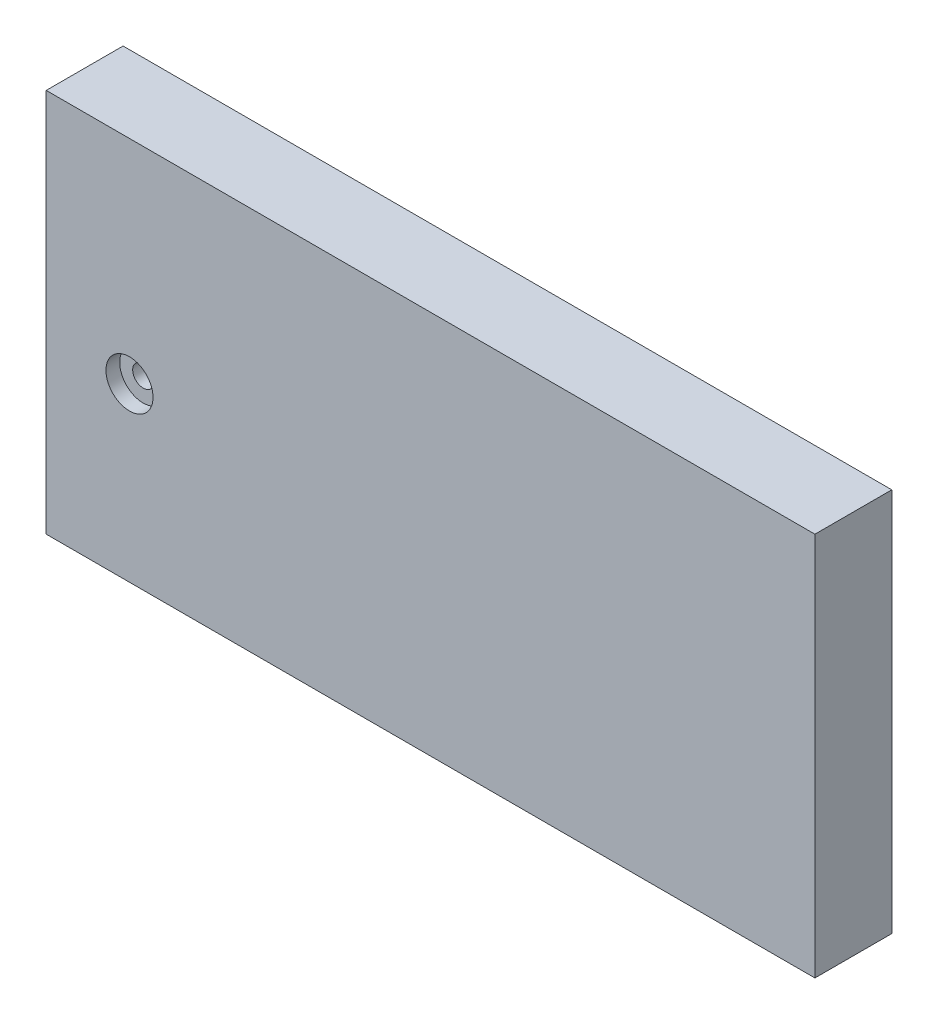
ISO-10303-21;
HEADER;
FILE_DESCRIPTION(('STEP AP214'),'2;1');
FILE_NAME('part.step','',(''),(''),'','','');
FILE_SCHEMA(('AUTOMOTIVE_DESIGN { 1 0 10303 214 1 1 1 1 }'));
ENDSEC;
DATA;
#1=APPLICATION_CONTEXT('core data for automotive mechanical design processes');
#2=APPLICATION_PROTOCOL_DEFINITION('international standard','automotive_design',2000,#1);
#3=PRODUCT_CONTEXT('',#1,'mechanical');
#4=PRODUCT('Part','Part','',(#3));
#5=PRODUCT_RELATED_PRODUCT_CATEGORY('part','',(#4));
#6=PRODUCT_DEFINITION_FORMATION('','',#4);
#7=PRODUCT_DEFINITION_CONTEXT('part definition',#1,'design');
#8=PRODUCT_DEFINITION('design','',#6,#7);
#9=PRODUCT_DEFINITION_SHAPE('','',#8);
#10=(LENGTH_UNIT() NAMED_UNIT(*) SI_UNIT(.MILLI.,.METRE.));
#11=(NAMED_UNIT(*) PLANE_ANGLE_UNIT() SI_UNIT($,.RADIAN.));
#12=(NAMED_UNIT(*) SI_UNIT($,.STERADIAN.) SOLID_ANGLE_UNIT());
#13=UNCERTAINTY_MEASURE_WITH_UNIT(LENGTH_MEASURE(1.E-05),#10,'distance_accuracy_value','');
#14=(GEOMETRIC_REPRESENTATION_CONTEXT(3) GLOBAL_UNCERTAINTY_ASSIGNED_CONTEXT((#13)) GLOBAL_UNIT_ASSIGNED_CONTEXT((#10,
#11,#12)) REPRESENTATION_CONTEXT('',''));
#15=CARTESIAN_POINT('',(0.,0.,0.));
#16=DIRECTION('',(0.,0.,1.));
#17=DIRECTION('',(1.,0.,0.));
#18=AXIS2_PLACEMENT_3D('',#15,#16,#17);
#19=CARTESIAN_POINT('',(0.,0.,20.));
#20=DIRECTION('',(1.,0.,0.));
#21=DIRECTION('',(0.,0.,-1.));
#22=AXIS2_PLACEMENT_3D('',#19,#20,#21);
#23=PLANE('',#22);
#24=DIRECTION('',(0.,-1.,0.));
#25=VECTOR('',#24,1.);
#26=CARTESIAN_POINT('',(0.,0.,0.));
#27=LINE('',#26,#25);
#28=CARTESIAN_POINT('',(0.,100.,0.));
#29=VERTEX_POINT('',#28);
#30=CARTESIAN_POINT('',(0.,0.,0.));
#31=VERTEX_POINT('',#30);
#32=EDGE_CURVE('E96',#29,#31,#27,.T.);
#33=ORIENTED_EDGE('',*,*,#32,.T.);
#34=DIRECTION('',(0.,0.,-1.));
#35=VECTOR('',#34,1.);
#36=CARTESIAN_POINT('',(0.,0.,20.));
#37=LINE('',#36,#35);
#38=CARTESIAN_POINT('',(0.,0.,20.));
#39=VERTEX_POINT('',#38);
#40=EDGE_CURVE('E11',#39,#31,#37,.T.);
#41=ORIENTED_EDGE('',*,*,#40,.F.);
#42=DIRECTION('',(0.,-1.,0.));
#43=VECTOR('',#42,1.);
#44=CARTESIAN_POINT('',(0.,0.,20.));
#45=LINE('',#44,#43);
#46=CARTESIAN_POINT('',(0.,100.,20.));
#47=VERTEX_POINT('',#46);
#48=EDGE_CURVE('E84',#47,#39,#45,.T.);
#49=ORIENTED_EDGE('',*,*,#48,.F.);
#50=DIRECTION('',(0.,0.,-1.));
#51=VECTOR('',#50,1.);
#52=CARTESIAN_POINT('',(0.,100.,20.));
#53=LINE('',#52,#51);
#54=EDGE_CURVE('E92',#47,#29,#53,.T.);
#55=ORIENTED_EDGE('',*,*,#54,.T.);
#56=EDGE_LOOP('',(#33,#41,#49,#55));
#57=FACE_BOUND('',#56,.T.);
#58=ADVANCED_FACE('F33',(#57),#23,.F.);
#59=CARTESIAN_POINT('',(0.,0.,20.));
#60=DIRECTION('',(0.,1.,0.));
#61=DIRECTION('',(0.,0.,1.));
#62=AXIS2_PLACEMENT_3D('',#59,#60,#61);
#63=PLANE('',#62);
#64=DIRECTION('',(1.,0.,0.));
#65=VECTOR('',#64,1.);
#66=CARTESIAN_POINT('',(0.,0.,0.));
#67=LINE('',#66,#65);
#68=CARTESIAN_POINT('',(200.,0.,0.));
#69=VERTEX_POINT('',#68);
#70=EDGE_CURVE('E88',#31,#69,#67,.T.);
#71=ORIENTED_EDGE('',*,*,#70,.T.);
#72=DIRECTION('',(0.,0.,-1.));
#73=VECTOR('',#72,1.);
#74=CARTESIAN_POINT('',(200.,0.,20.));
#75=LINE('',#74,#73);
#76=CARTESIAN_POINT('',(200.,0.,20.));
#77=VERTEX_POINT('',#76);
#78=EDGE_CURVE('E41',#77,#69,#75,.T.);
#79=ORIENTED_EDGE('',*,*,#78,.F.);
#80=DIRECTION('',(1.,0.,0.));
#81=VECTOR('',#80,1.);
#82=CARTESIAN_POINT('',(0.,0.,20.));
#83=LINE('',#82,#81);
#84=EDGE_CURVE('E79',#39,#77,#83,.T.);
#85=ORIENTED_EDGE('',*,*,#84,.F.);
#86=ORIENTED_EDGE('',*,*,#40,.T.);
#87=EDGE_LOOP('',(#71,#79,#85,#86));
#88=FACE_BOUND('',#87,.T.);
#89=ADVANCED_FACE('F87',(#88),#63,.F.);
#90=CARTESIAN_POINT('',(200.,0.,20.));
#91=DIRECTION('',(-1.,0.,0.));
#92=DIRECTION('',(0.,0.,1.));
#93=AXIS2_PLACEMENT_3D('',#90,#91,#92);
#94=PLANE('',#93);
#95=DIRECTION('',(0.,1.,0.));
#96=VECTOR('',#95,1.);
#97=CARTESIAN_POINT('',(200.,0.,0.));
#98=LINE('',#97,#96);
#99=CARTESIAN_POINT('',(200.,100.,0.));
#100=VERTEX_POINT('',#99);
#101=EDGE_CURVE('E66',#69,#100,#98,.T.);
#102=ORIENTED_EDGE('',*,*,#101,.T.);
#103=DIRECTION('',(0.,0.,-1.));
#104=VECTOR('',#103,1.);
#105=CARTESIAN_POINT('',(200.,100.,20.));
#106=LINE('',#105,#104);
#107=CARTESIAN_POINT('',(200.,100.,20.));
#108=VERTEX_POINT('',#107);
#109=EDGE_CURVE('E89',#108,#100,#106,.T.);
#110=ORIENTED_EDGE('',*,*,#109,.F.);
#111=DIRECTION('',(0.,1.,0.));
#112=VECTOR('',#111,1.);
#113=CARTESIAN_POINT('',(200.,0.,20.));
#114=LINE('',#113,#112);
#115=EDGE_CURVE('E82',#77,#108,#114,.T.);
#116=ORIENTED_EDGE('',*,*,#115,.F.);
#117=ORIENTED_EDGE('',*,*,#78,.T.);
#118=EDGE_LOOP('',(#102,#110,#116,#117));
#119=FACE_BOUND('',#118,.T.);
#120=ADVANCED_FACE('F90',(#119),#94,.F.);
#121=CARTESIAN_POINT('',(0.,100.,20.));
#122=DIRECTION('',(0.,-1.,0.));
#123=DIRECTION('',(0.,0.,-1.));
#124=AXIS2_PLACEMENT_3D('',#121,#122,#123);
#125=PLANE('',#124);
#126=DIRECTION('',(-1.,0.,0.));
#127=VECTOR('',#126,1.);
#128=CARTESIAN_POINT('',(0.,100.,0.));
#129=LINE('',#128,#127);
#130=EDGE_CURVE('E72',#100,#29,#129,.T.);
#131=ORIENTED_EDGE('',*,*,#130,.T.);
#132=ORIENTED_EDGE('',*,*,#54,.F.);
#133=DIRECTION('',(-1.,0.,0.));
#134=VECTOR('',#133,1.);
#135=CARTESIAN_POINT('',(0.,100.,20.));
#136=LINE('',#135,#134);
#137=EDGE_CURVE('E49',#108,#47,#136,.T.);
#138=ORIENTED_EDGE('',*,*,#137,.F.);
#139=ORIENTED_EDGE('',*,*,#109,.T.);
#140=EDGE_LOOP('',(#131,#132,#138,#139));
#141=FACE_BOUND('',#140,.T.);
#142=ADVANCED_FACE('F104',(#141),#125,.F.);
#143=CARTESIAN_POINT('',(0.,0.,20.));
#144=DIRECTION('',(0.,0.,-1.));
#145=DIRECTION('',(-1.,0.,0.));
#146=AXIS2_PLACEMENT_3D('',#143,#144,#145);
#147=PLANE('',#146);
#148=CARTESIAN_POINT('',(21.6628591303376,44.7040155975742,20.));
#149=DIRECTION('',(0.,0.,1.));
#150=DIRECTION('',(1.,0.,0.));
#151=AXIS2_PLACEMENT_3D('',#148,#149,#150);
#152=CIRCLE('',#151,6.12);
#153=CARTESIAN_POINT('',(27.7828591303376,44.7040155975742,20.));
#154=VERTEX_POINT('',#153);
#155=EDGE_CURVE('E118',#154,#154,#152,.T.);
#156=ORIENTED_EDGE('',*,*,#155,.F.);
#157=EDGE_LOOP('',(#156));
#158=FACE_BOUND('',#157,.T.);
#159=ORIENTED_EDGE('',*,*,#48,.T.);
#160=ORIENTED_EDGE('',*,*,#84,.T.);
#161=ORIENTED_EDGE('',*,*,#115,.T.);
#162=ORIENTED_EDGE('',*,*,#137,.T.);
#163=EDGE_LOOP('',(#159,#160,#161,#162));
#164=FACE_BOUND('',#163,.T.);
#165=ADVANCED_FACE('F80',(#158,#164),#147,.F.);
#166=CARTESIAN_POINT('',(0.,0.,0.));
#167=DIRECTION('',(0.,0.,-1.));
#168=DIRECTION('',(-1.,0.,0.));
#169=AXIS2_PLACEMENT_3D('',#166,#167,#168);
#170=PLANE('',#169);
#171=CARTESIAN_POINT('',(21.6628591303376,44.7040155975742,0.));
#172=DIRECTION('',(0.,0.,1.));
#173=DIRECTION('',(1.,0.,0.));
#174=AXIS2_PLACEMENT_3D('',#171,#172,#173);
#175=CIRCLE('',#174,2.75);
#176=CARTESIAN_POINT('',(24.4128591303376,44.7040155975742,0.));
#177=VERTEX_POINT('',#176);
#178=EDGE_CURVE('E99',#177,#177,#175,.T.);
#179=ORIENTED_EDGE('',*,*,#178,.T.);
#180=EDGE_LOOP('',(#179));
#181=FACE_BOUND('',#180,.T.);
#182=ORIENTED_EDGE('',*,*,#32,.F.);
#183=ORIENTED_EDGE('',*,*,#130,.F.);
#184=ORIENTED_EDGE('',*,*,#101,.F.);
#185=ORIENTED_EDGE('',*,*,#70,.F.);
#186=EDGE_LOOP('',(#182,#183,#184,#185));
#187=FACE_BOUND('',#186,.T.);
#188=ADVANCED_FACE('F107',(#181,#187),#170,.T.);
#189=CARTESIAN_POINT('',(21.6628591303376,44.7040155975742,20.));
#190=DIRECTION('',(0.,0.,1.));
#191=DIRECTION('',(1.,0.,0.));
#192=AXIS2_PLACEMENT_3D('',#189,#190,#191);
#193=CYLINDRICAL_SURFACE('',#192,2.75);
#194=ORIENTED_EDGE('',*,*,#178,.F.);
#195=EDGE_LOOP('',(#194));
#196=FACE_BOUND('',#195,.T.);
#197=CARTESIAN_POINT('',(21.6628591303376,44.7040155975742,16.42));
#198=DIRECTION('',(0.,0.,1.));
#199=DIRECTION('',(1.,0.,0.));
#200=AXIS2_PLACEMENT_3D('',#197,#198,#199);
#201=CIRCLE('',#200,2.75);
#202=CARTESIAN_POINT('',(24.4128591303376,44.7040155975742,16.42));
#203=VERTEX_POINT('',#202);
#204=EDGE_CURVE('E112',#203,#203,#201,.T.);
#205=ORIENTED_EDGE('',*,*,#204,.T.);
#206=EDGE_LOOP('',(#205));
#207=FACE_BOUND('',#206,.T.);
#208=ADVANCED_FACE('F130',(#196,#207),#193,.F.);
#209=CARTESIAN_POINT('',(24.4128591303376,44.7040155975742,16.42));
#210=DIRECTION('',(0.,0.,-1.));
#211=DIRECTION('',(-1.,0.,0.));
#212=AXIS2_PLACEMENT_3D('',#209,#210,#211);
#213=PLANE('',#212);
#214=ORIENTED_EDGE('',*,*,#204,.F.);
#215=EDGE_LOOP('',(#214));
#216=FACE_BOUND('',#215,.T.);
#217=CARTESIAN_POINT('',(21.6628591303376,44.7040155975742,16.42));
#218=DIRECTION('',(0.,0.,1.));
#219=DIRECTION('',(1.,0.,0.));
#220=AXIS2_PLACEMENT_3D('',#217,#218,#219);
#221=CIRCLE('',#220,6.12);
#222=CARTESIAN_POINT('',(27.7828591303376,44.7040155975742,16.42));
#223=VERTEX_POINT('',#222);
#224=EDGE_CURVE('E115',#223,#223,#221,.T.);
#225=ORIENTED_EDGE('',*,*,#224,.T.);
#226=EDGE_LOOP('',(#225));
#227=FACE_BOUND('',#226,.T.);
#228=ADVANCED_FACE('F168',(#216,#227),#213,.F.);
#229=CARTESIAN_POINT('',(21.6628591303376,44.7040155975742,20.));
#230=DIRECTION('',(0.,0.,1.));
#231=DIRECTION('',(1.,0.,0.));
#232=AXIS2_PLACEMENT_3D('',#229,#230,#231);
#233=CYLINDRICAL_SURFACE('',#232,6.12);
#234=ORIENTED_EDGE('',*,*,#224,.F.);
#235=EDGE_LOOP('',(#234));
#236=FACE_BOUND('',#235,.T.);
#237=ORIENTED_EDGE('',*,*,#155,.T.);
#238=EDGE_LOOP('',(#237));
#239=FACE_BOUND('',#238,.T.);
#240=ADVANCED_FACE('F122',(#236,#239),#233,.F.);
#241=CLOSED_SHELL('',(#58,#89,#120,#142,#165,#188,#208,#228,#240));
#242=MANIFOLD_SOLID_BREP('B2',#241);
#243=ADVANCED_BREP_SHAPE_REPRESENTATION('',(#18,#242),#14);
#244=SHAPE_DEFINITION_REPRESENTATION(#9,#243);
ENDSEC;
END-ISO-10303-21;
